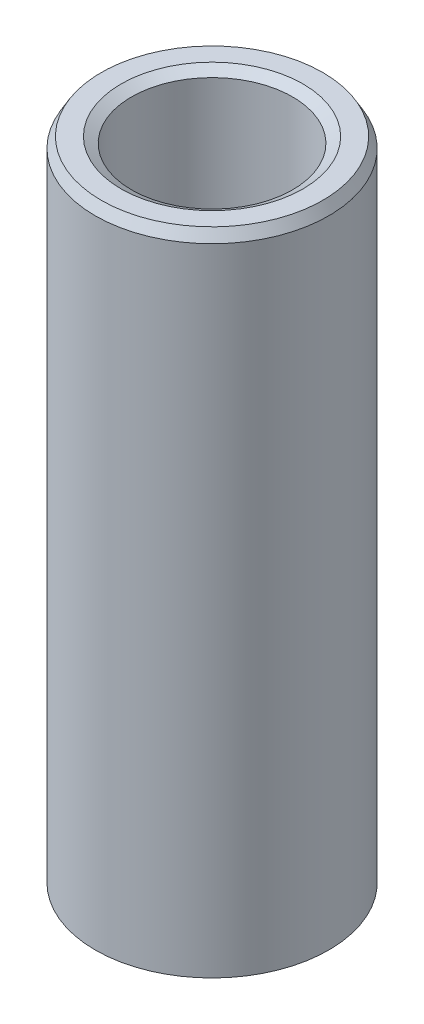
ISO-10303-21;
HEADER;
FILE_DESCRIPTION(('STEP AP214'),'2;1');
FILE_NAME('part.step','',(''),(''),'','','');
FILE_SCHEMA(('AUTOMOTIVE_DESIGN { 1 0 10303 214 1 1 1 1 }'));
ENDSEC;
DATA;
#1=APPLICATION_CONTEXT('core data for automotive mechanical design processes');
#2=APPLICATION_PROTOCOL_DEFINITION('international standard','automotive_design',2000,#1);
#3=PRODUCT_CONTEXT('',#1,'mechanical');
#4=PRODUCT('Part','Part','',(#3));
#5=PRODUCT_RELATED_PRODUCT_CATEGORY('part','',(#4));
#6=PRODUCT_DEFINITION_FORMATION('','',#4);
#7=PRODUCT_DEFINITION_CONTEXT('part definition',#1,'design');
#8=PRODUCT_DEFINITION('design','',#6,#7);
#9=PRODUCT_DEFINITION_SHAPE('','',#8);
#10=(LENGTH_UNIT() NAMED_UNIT(*) SI_UNIT(.MILLI.,.METRE.));
#11=(NAMED_UNIT(*) PLANE_ANGLE_UNIT() SI_UNIT($,.RADIAN.));
#12=(NAMED_UNIT(*) SI_UNIT($,.STERADIAN.) SOLID_ANGLE_UNIT());
#13=UNCERTAINTY_MEASURE_WITH_UNIT(LENGTH_MEASURE(1.E-05),#10,'distance_accuracy_value','');
#14=(GEOMETRIC_REPRESENTATION_CONTEXT(3) GLOBAL_UNCERTAINTY_ASSIGNED_CONTEXT((#13)) GLOBAL_UNIT_ASSIGNED_CONTEXT((#10,
#11,#12)) REPRESENTATION_CONTEXT('',''));
#15=CARTESIAN_POINT('',(0.,0.,0.));
#16=DIRECTION('',(0.,0.,1.));
#17=DIRECTION('',(1.,0.,0.));
#18=AXIS2_PLACEMENT_3D('',#15,#16,#17);
#19=CARTESIAN_POINT('',(0.,223.445164522931,0.));
#20=DIRECTION('',(0.,-1.,0.));
#21=DIRECTION('',(0.,0.,-1.));
#22=AXIS2_PLACEMENT_3D('',#19,#20,#21);
#23=CYLINDRICAL_SURFACE('',#22,40.);
#24=CARTESIAN_POINT('',(0.,2.0566898780478,0.));
#25=DIRECTION('',(0.,1.,0.));
#26=DIRECTION('',(0.,0.,1.));
#27=AXIS2_PLACEMENT_3D('',#24,#25,#26);
#28=CIRCLE('',#27,40.);
#29=CARTESIAN_POINT('',(0.,2.0566898780478,40.));
#30=VERTEX_POINT('',#29);
#31=EDGE_CURVE('E10',#30,#30,#28,.T.);
#32=ORIENTED_EDGE('',*,*,#31,.T.);
#33=EDGE_LOOP('',(#32));
#34=FACE_BOUND('',#33,.T.);
#35=CARTESIAN_POINT('',(0.,219.88287315874,0.));
#36=DIRECTION('',(0.,1.,0.));
#37=DIRECTION('',(0.,0.,1.));
#38=AXIS2_PLACEMENT_3D('',#35,#36,#37);
#39=CIRCLE('',#38,40.);
#40=CARTESIAN_POINT('',(0.,219.88287315874,40.));
#41=VERTEX_POINT('',#40);
#42=EDGE_CURVE('E50',#41,#41,#39,.F.);
#43=ORIENTED_EDGE('',*,*,#42,.T.);
#44=EDGE_LOOP('',(#43));
#45=FACE_BOUND('',#44,.T.);
#46=ADVANCED_FACE('F39',(#34,#45),#23,.T.);
#47=CARTESIAN_POINT('',(0.,223.445164522931,0.));
#48=DIRECTION('',(0.,1.,0.));
#49=DIRECTION('',(0.,0.,1.));
#50=AXIS2_PLACEMENT_3D('',#47,#48,#49);
#51=PLANE('',#50);
#52=CARTESIAN_POINT('',(0.,223.445164522931,0.));
#53=DIRECTION('',(0.,1.,0.));
#54=DIRECTION('',(0.,0.,1.));
#55=AXIS2_PLACEMENT_3D('',#52,#53,#54);
#56=CIRCLE('',#55,31.1577858089185);
#57=CARTESIAN_POINT('',(0.,223.445164522931,31.1577858089185));
#58=VERTEX_POINT('',#57);
#59=EDGE_CURVE('E58',#58,#58,#56,.F.);
#60=ORIENTED_EDGE('',*,*,#59,.T.);
#61=EDGE_LOOP('',(#60));
#62=FACE_BOUND('',#61,.T.);
#63=CARTESIAN_POINT('',(0.,223.445164522931,0.));
#64=DIRECTION('',(0.,1.,0.));
#65=DIRECTION('',(0.,0.,1.));
#66=AXIS2_PLACEMENT_3D('',#63,#64,#65);
#67=CIRCLE('',#66,37.9433101219522);
#68=CARTESIAN_POINT('',(0.,223.445164522931,37.9433101219522));
#69=VERTEX_POINT('',#68);
#70=EDGE_CURVE('E61',#69,#69,#67,.T.);
#71=ORIENTED_EDGE('',*,*,#70,.T.);
#72=EDGE_LOOP('',(#71));
#73=FACE_BOUND('',#72,.T.);
#74=ADVANCED_FACE('F88',(#62,#73),#51,.T.);
#75=CARTESIAN_POINT('',(0.,0.,0.));
#76=DIRECTION('',(0.,1.,0.));
#77=DIRECTION('',(0.,0.,1.));
#78=AXIS2_PLACEMENT_3D('',#75,#76,#77);
#79=PLANE('',#78);
#80=CARTESIAN_POINT('',(0.,0.,0.));
#81=DIRECTION('',(0.,1.,0.));
#82=DIRECTION('',(0.,0.,1.));
#83=AXIS2_PLACEMENT_3D('',#80,#81,#82);
#84=CIRCLE('',#83,29.652184322775);
#85=CARTESIAN_POINT('',(0.,0.,29.652184322775));
#86=VERTEX_POINT('',#85);
#87=EDGE_CURVE('E51',#86,#86,#84,.T.);
#88=ORIENTED_EDGE('',*,*,#87,.T.);
#89=EDGE_LOOP('',(#88));
#90=FACE_BOUND('',#89,.T.);
#91=CARTESIAN_POINT('',(0.,0.,0.));
#92=DIRECTION('',(0.,1.,0.));
#93=DIRECTION('',(0.,0.,1.));
#94=AXIS2_PLACEMENT_3D('',#91,#92,#93);
#95=CIRCLE('',#94,36.4377086358086);
#96=CARTESIAN_POINT('',(0.,0.,36.4377086358086));
#97=VERTEX_POINT('',#96);
#98=EDGE_CURVE('E54',#97,#97,#95,.F.);
#99=ORIENTED_EDGE('',*,*,#98,.T.);
#100=EDGE_LOOP('',(#99));
#101=FACE_BOUND('',#100,.T.);
#102=ADVANCED_FACE('F83',(#90,#101),#79,.F.);
#103=CARTESIAN_POINT('',(0.,223.445164522931,0.));
#104=DIRECTION('',(0.,-1.,0.));
#105=DIRECTION('',(0.,0.,-1.));
#106=AXIS2_PLACEMENT_3D('',#103,#104,#105);
#107=CYLINDRICAL_SURFACE('',#106,27.5954944447272);
#108=CARTESIAN_POINT('',(0.,221.388474644884,0.));
#109=DIRECTION('',(0.,1.,0.));
#110=DIRECTION('',(0.,0.,1.));
#111=AXIS2_PLACEMENT_3D('',#108,#109,#110);
#112=CIRCLE('',#111,27.5954944447272);
#113=CARTESIAN_POINT('',(0.,221.388474644884,27.5954944447272));
#114=VERTEX_POINT('',#113);
#115=EDGE_CURVE('E67',#114,#114,#112,.T.);
#116=ORIENTED_EDGE('',*,*,#115,.T.);
#117=EDGE_LOOP('',(#116));
#118=FACE_BOUND('',#117,.T.);
#119=CARTESIAN_POINT('',(0.,3.56229136419145,0.));
#120=DIRECTION('',(0.,1.,0.));
#121=DIRECTION('',(0.,0.,1.));
#122=AXIS2_PLACEMENT_3D('',#119,#120,#121);
#123=CIRCLE('',#122,27.5954944447272);
#124=CARTESIAN_POINT('',(0.,3.56229136419145,27.5954944447272));
#125=VERTEX_POINT('',#124);
#126=EDGE_CURVE('E69',#125,#125,#123,.F.);
#127=ORIENTED_EDGE('',*,*,#126,.T.);
#128=EDGE_LOOP('',(#127));
#129=FACE_BOUND('',#128,.T.);
#130=ADVANCED_FACE('F71',(#118,#129),#107,.F.);
#131=CARTESIAN_POINT('',(0.,221.388474644884,0.));
#132=DIRECTION('',(0.,1.,0.));
#133=DIRECTION('',(0.,0.,1.));
#134=AXIS2_PLACEMENT_3D('',#131,#132,#133);
#135=CONICAL_SURFACE('',#134,27.5954944447272,1.0471975511966);
#136=ORIENTED_EDGE('',*,*,#59,.F.);
#137=EDGE_LOOP('',(#136));
#138=FACE_BOUND('',#137,.T.);
#139=ORIENTED_EDGE('',*,*,#115,.F.);
#140=EDGE_LOOP('',(#139));
#141=FACE_BOUND('',#140,.T.);
#142=ADVANCED_FACE('F77',(#138,#141),#135,.F.);
#143=CARTESIAN_POINT('',(0.,0.,0.));
#144=DIRECTION('',(0.,-1.,0.));
#145=DIRECTION('',(0.,0.,-1.));
#146=AXIS2_PLACEMENT_3D('',#143,#144,#145);
#147=CONICAL_SURFACE('',#146,29.652184322775,0.523598775598298);
#148=ORIENTED_EDGE('',*,*,#126,.F.);
#149=EDGE_LOOP('',(#148));
#150=FACE_BOUND('',#149,.T.);
#151=ORIENTED_EDGE('',*,*,#87,.F.);
#152=EDGE_LOOP('',(#151));
#153=FACE_BOUND('',#152,.T.);
#154=ADVANCED_FACE('F73',(#150,#153),#147,.F.);
#155=CARTESIAN_POINT('',(0.,2.0566898780478,0.));
#156=DIRECTION('',(0.,1.,0.));
#157=DIRECTION('',(0.,0.,1.));
#158=AXIS2_PLACEMENT_3D('',#155,#156,#157);
#159=CONICAL_SURFACE('',#158,40.,1.0471975511966);
#160=ORIENTED_EDGE('',*,*,#98,.F.);
#161=EDGE_LOOP('',(#160));
#162=FACE_BOUND('',#161,.T.);
#163=ORIENTED_EDGE('',*,*,#31,.F.);
#164=EDGE_LOOP('',(#163));
#165=FACE_BOUND('',#164,.T.);
#166=ADVANCED_FACE('F76',(#162,#165),#159,.T.);
#167=CARTESIAN_POINT('',(0.,223.445164522931,0.));
#168=DIRECTION('',(0.,-1.,0.));
#169=DIRECTION('',(0.,0.,-1.));
#170=AXIS2_PLACEMENT_3D('',#167,#168,#169);
#171=CONICAL_SURFACE('',#170,37.9433101219522,0.523598775598292);
#172=ORIENTED_EDGE('',*,*,#42,.F.);
#173=EDGE_LOOP('',(#172));
#174=FACE_BOUND('',#173,.T.);
#175=ORIENTED_EDGE('',*,*,#70,.F.);
#176=EDGE_LOOP('',(#175));
#177=FACE_BOUND('',#176,.T.);
#178=ADVANCED_FACE('F45',(#174,#177),#171,.T.);
#179=CLOSED_SHELL('',(#46,#74,#102,#130,#142,#154,#166,#178));
#180=MANIFOLD_SOLID_BREP('B2',#179);
#181=ADVANCED_BREP_SHAPE_REPRESENTATION('',(#18,#180),#14);
#182=SHAPE_DEFINITION_REPRESENTATION(#9,#181);
ENDSEC;
END-ISO-10303-21;
